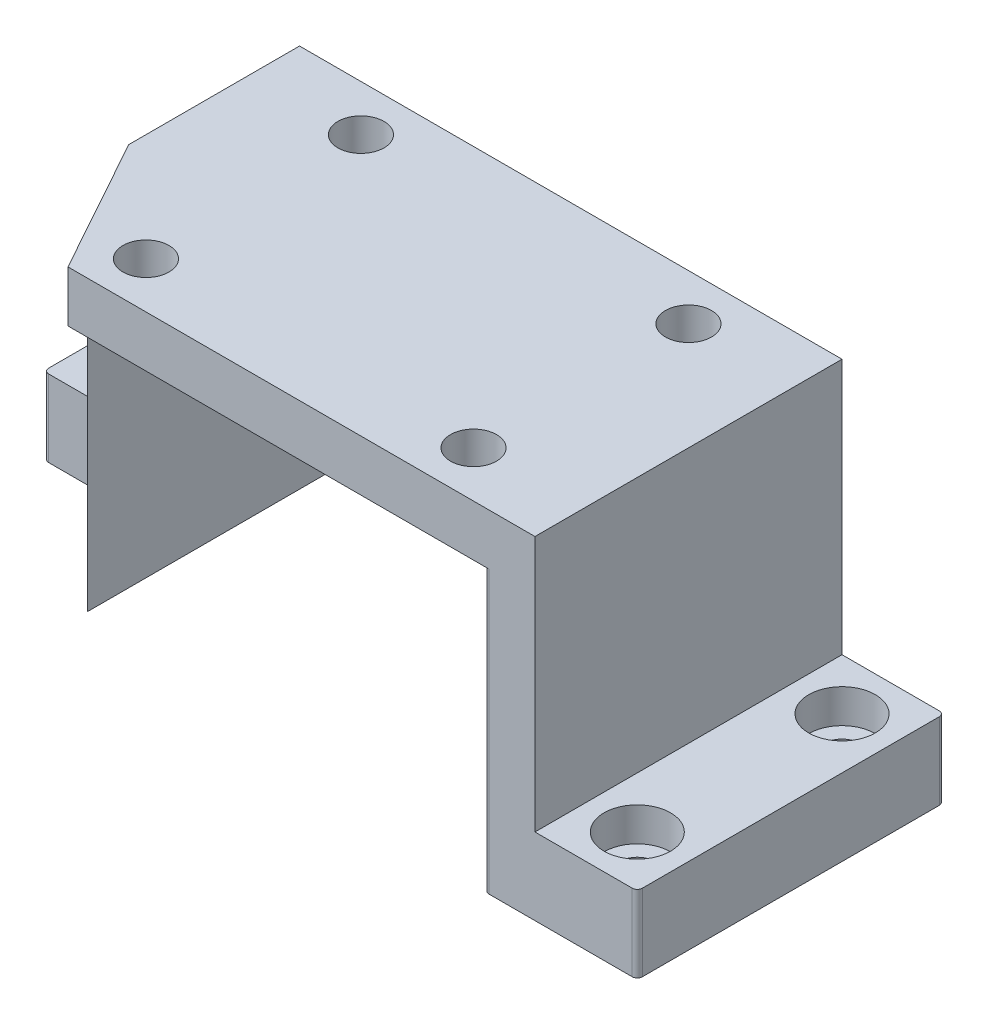
ISO-10303-21;
HEADER;
FILE_DESCRIPTION(('STEP AP214'),'2;1');
FILE_NAME('part.step','',(''),(''),'','','');
FILE_SCHEMA(('AUTOMOTIVE_DESIGN { 1 0 10303 214 1 1 1 1 }'));
ENDSEC;
DATA;
#1=APPLICATION_CONTEXT('core data for automotive mechanical design processes');
#2=APPLICATION_PROTOCOL_DEFINITION('international standard','automotive_design',2000,#1);
#3=PRODUCT_CONTEXT('',#1,'mechanical');
#4=PRODUCT('Part','Part','',(#3));
#5=PRODUCT_RELATED_PRODUCT_CATEGORY('part','',(#4));
#6=PRODUCT_DEFINITION_FORMATION('','',#4);
#7=PRODUCT_DEFINITION_CONTEXT('part definition',#1,'design');
#8=PRODUCT_DEFINITION('design','',#6,#7);
#9=PRODUCT_DEFINITION_SHAPE('','',#8);
#10=(LENGTH_UNIT() NAMED_UNIT(*) SI_UNIT(.MILLI.,.METRE.));
#11=(NAMED_UNIT(*) PLANE_ANGLE_UNIT() SI_UNIT($,.RADIAN.));
#12=(NAMED_UNIT(*) SI_UNIT($,.STERADIAN.) SOLID_ANGLE_UNIT());
#13=UNCERTAINTY_MEASURE_WITH_UNIT(LENGTH_MEASURE(1.E-05),#10,'distance_accuracy_value','');
#14=(GEOMETRIC_REPRESENTATION_CONTEXT(3) GLOBAL_UNCERTAINTY_ASSIGNED_CONTEXT((#13)) GLOBAL_UNIT_ASSIGNED_CONTEXT((#10,
#11,#12)) REPRESENTATION_CONTEXT('',''));
#15=CARTESIAN_POINT('',(0.,0.,0.));
#16=DIRECTION('',(0.,0.,1.));
#17=DIRECTION('',(1.,0.,0.));
#18=AXIS2_PLACEMENT_3D('',#15,#16,#17);
#19=CARTESIAN_POINT('',(-53.,10.,30.));
#20=DIRECTION('',(1.,0.,0.));
#21=DIRECTION('',(0.,0.,-1.));
#22=AXIS2_PLACEMENT_3D('',#19,#20,#21);
#23=PLANE('',#22);
#24=DIRECTION('',(0.,0.,-1.));
#25=VECTOR('',#24,1.);
#26=CARTESIAN_POINT('',(-53.,-55.,30.));
#27=LINE('',#26,#25);
#28=CARTESIAN_POINT('',(-53.,-55.,3.37045108443876));
#29=VERTEX_POINT('',#28);
#30=CARTESIAN_POINT('',(-53.,-55.,0.));
#31=VERTEX_POINT('',#30);
#32=EDGE_CURVE('E378',#29,#31,#27,.T.);
#33=ORIENTED_EDGE('',*,*,#32,.F.);
#34=DIRECTION('',(0.,1.,0.));
#35=VECTOR('',#34,1.);
#36=CARTESIAN_POINT('',(-53.,-55.,3.37045108443878));
#37=LINE('',#36,#35);
#38=CARTESIAN_POINT('',(-53.,10.,3.37045108443878));
#39=VERTEX_POINT('',#38);
#40=EDGE_CURVE('E194',#29,#39,#37,.T.);
#41=ORIENTED_EDGE('',*,*,#40,.T.);
#42=DIRECTION('',(0.,0.,1.));
#43=VECTOR('',#42,1.);
#44=CARTESIAN_POINT('',(-53.,10.,30.));
#45=LINE('',#44,#43);
#46=CARTESIAN_POINT('',(-53.,10.,-30.));
#47=VERTEX_POINT('',#46);
#48=EDGE_CURVE('E203',#47,#39,#45,.T.);
#49=ORIENTED_EDGE('',*,*,#48,.F.);
#50=DIRECTION('',(0.,-1.,0.));
#51=VECTOR('',#50,1.);
#52=CARTESIAN_POINT('',(-53.,10.,-30.));
#53=LINE('',#52,#51);
#54=CARTESIAN_POINT('',(-53.,-40.,-30.));
#55=VERTEX_POINT('',#54);
#56=EDGE_CURVE('E215',#47,#55,#53,.T.);
#57=ORIENTED_EDGE('',*,*,#56,.T.);
#58=DIRECTION('',(0.,0.,-1.));
#59=VECTOR('',#58,1.);
#60=CARTESIAN_POINT('',(-53.,-40.,-30.));
#61=LINE('',#60,#59);
#62=CARTESIAN_POINT('',(-53.,-40.,0.));
#63=VERTEX_POINT('',#62);
#64=EDGE_CURVE('E500',#63,#55,#61,.T.);
#65=ORIENTED_EDGE('',*,*,#64,.F.);
#66=DIRECTION('',(0.,1.,0.));
#67=VECTOR('',#66,1.);
#68=CARTESIAN_POINT('',(-53.,-40.,0.));
#69=LINE('',#68,#67);
#70=EDGE_CURVE('E494',#31,#63,#69,.T.);
#71=ORIENTED_EDGE('',*,*,#70,.F.);
#72=EDGE_LOOP('',(#33,#41,#49,#57,#65,#71));
#73=FACE_BOUND('',#72,.T.);
#74=ADVANCED_FACE('F42',(#73),#23,.F.);
#75=CARTESIAN_POINT('',(53.,10.,30.));
#76=DIRECTION('',(-1.,0.,0.));
#77=DIRECTION('',(0.,0.,1.));
#78=AXIS2_PLACEMENT_3D('',#75,#76,#77);
#79=PLANE('',#78);
#80=DIRECTION('',(0.,0.,1.));
#81=VECTOR('',#80,1.);
#82=CARTESIAN_POINT('',(53.,-40.,30.));
#83=LINE('',#82,#81);
#84=CARTESIAN_POINT('',(53.,-40.,-30.));
#85=VERTEX_POINT('',#84);
#86=CARTESIAN_POINT('',(53.,-40.,30.));
#87=VERTEX_POINT('',#86);
#88=EDGE_CURVE('E517',#85,#87,#83,.T.);
#89=ORIENTED_EDGE('',*,*,#88,.F.);
#90=DIRECTION('',(0.,-1.,0.));
#91=VECTOR('',#90,1.);
#92=CARTESIAN_POINT('',(53.,10.,-30.));
#93=LINE('',#92,#91);
#94=CARTESIAN_POINT('',(53.,10.,-30.));
#95=VERTEX_POINT('',#94);
#96=EDGE_CURVE('E231',#95,#85,#93,.T.);
#97=ORIENTED_EDGE('',*,*,#96,.F.);
#98=DIRECTION('',(0.,0.,-1.));
#99=VECTOR('',#98,1.);
#100=CARTESIAN_POINT('',(53.,10.,30.));
#101=LINE('',#100,#99);
#102=CARTESIAN_POINT('',(53.,10.,30.));
#103=VERTEX_POINT('',#102);
#104=EDGE_CURVE('E226',#103,#95,#101,.T.);
#105=ORIENTED_EDGE('',*,*,#104,.F.);
#106=DIRECTION('',(0.,-1.,0.));
#107=VECTOR('',#106,1.);
#108=CARTESIAN_POINT('',(53.,10.,30.));
#109=LINE('',#108,#107);
#110=EDGE_CURVE('E208',#103,#87,#109,.T.);
#111=ORIENTED_EDGE('',*,*,#110,.T.);
#112=EDGE_LOOP('',(#89,#97,#105,#111));
#113=FACE_BOUND('',#112,.T.);
#114=ADVANCED_FACE('F587',(#113),#79,.F.);
#115=CARTESIAN_POINT('',(0.,0.,0.));
#116=DIRECTION('',(0.,-1.,0.));
#117=DIRECTION('',(0.,0.,-1.));
#118=AXIS2_PLACEMENT_3D('',#115,#116,#117);
#119=PLANE('',#118);
#120=DIRECTION('',(0.484809620246341,0.,0.874619707139394));
#121=VECTOR('',#120,1.);
#122=CARTESIAN_POINT('',(-41.9720128148531,0.,23.2654666109649));
#123=LINE('',#122,#121);
#124=CARTESIAN_POINT('',(-43.,0.,21.4109286371528));
#125=VERTEX_POINT('',#124);
#126=CARTESIAN_POINT('',(-38.239,0.,30.));
#127=VERTEX_POINT('',#126);
#128=EDGE_CURVE('E191',#125,#127,#123,.T.);
#129=ORIENTED_EDGE('',*,*,#128,.F.);
#130=DIRECTION('',(0.,0.,1.));
#131=VECTOR('',#130,1.);
#132=CARTESIAN_POINT('',(-43.,0.,30.));
#133=LINE('',#132,#131);
#134=CARTESIAN_POINT('',(-43.,0.,-29.));
#135=VERTEX_POINT('',#134);
#136=EDGE_CURVE('E361',#135,#125,#133,.T.);
#137=ORIENTED_EDGE('',*,*,#136,.F.);
#138=CARTESIAN_POINT('',(-44.,0.,-29.));
#139=DIRECTION('',(0.,-1.,0.));
#140=DIRECTION('',(0.,0.,-1.));
#141=AXIS2_PLACEMENT_3D('',#138,#139,#140);
#142=CIRCLE('',#141,1.);
#143=CARTESIAN_POINT('',(-44.,0.,-30.));
#144=VERTEX_POINT('',#143);
#145=EDGE_CURVE('E321',#135,#144,#142,.F.);
#146=ORIENTED_EDGE('',*,*,#145,.T.);
#147=DIRECTION('',(-1.,0.,0.));
#148=VECTOR('',#147,1.);
#149=CARTESIAN_POINT('',(-53.,0.,-30.));
#150=LINE('',#149,#148);
#151=CARTESIAN_POINT('',(44.,0.,-30.));
#152=VERTEX_POINT('',#151);
#153=EDGE_CURVE('E221',#152,#144,#150,.T.);
#154=ORIENTED_EDGE('',*,*,#153,.F.);
#155=CARTESIAN_POINT('',(44.,0.,-29.));
#156=DIRECTION('',(0.,-1.,0.));
#157=DIRECTION('',(0.,0.,-1.));
#158=AXIS2_PLACEMENT_3D('',#155,#156,#157);
#159=CIRCLE('',#158,1.);
#160=CARTESIAN_POINT('',(43.,0.,-29.));
#161=VERTEX_POINT('',#160);
#162=EDGE_CURVE('E51',#152,#161,#159,.F.);
#163=ORIENTED_EDGE('',*,*,#162,.T.);
#164=DIRECTION('',(0.,0.,-1.));
#165=VECTOR('',#164,1.);
#166=CARTESIAN_POINT('',(43.,0.,30.));
#167=LINE('',#166,#165);
#168=CARTESIAN_POINT('',(43.,0.,29.));
#169=VERTEX_POINT('',#168);
#170=EDGE_CURVE('E535',#169,#161,#167,.T.);
#171=ORIENTED_EDGE('',*,*,#170,.F.);
#172=CARTESIAN_POINT('',(44.,0.,29.));
#173=DIRECTION('',(0.,-1.,0.));
#174=DIRECTION('',(0.,0.,-1.));
#175=AXIS2_PLACEMENT_3D('',#172,#173,#174);
#176=CIRCLE('',#175,1.);
#177=CARTESIAN_POINT('',(44.,0.,30.));
#178=VERTEX_POINT('',#177);
#179=EDGE_CURVE('E11',#169,#178,#176,.F.);
#180=ORIENTED_EDGE('',*,*,#179,.T.);
#181=DIRECTION('',(1.,0.,0.));
#182=VECTOR('',#181,1.);
#183=CARTESIAN_POINT('',(-53.,0.,30.));
#184=LINE('',#183,#182);
#185=EDGE_CURVE('E58',#127,#178,#184,.T.);
#186=ORIENTED_EDGE('',*,*,#185,.F.);
#187=EDGE_LOOP('',(#129,#137,#146,#154,#163,#171,#180,#186));
#188=FACE_BOUND('',#187,.T.);
#189=CARTESIAN_POINT('',(-32.,0.,21.));
#190=DIRECTION('',(0.,-1.,0.));
#191=DIRECTION('',(0.,0.,-1.));
#192=AXIS2_PLACEMENT_3D('',#189,#190,#191);
#193=CIRCLE('',#192,4.5);
#194=CARTESIAN_POINT('',(-32.,0.,16.5));
#195=VERTEX_POINT('',#194);
#196=EDGE_CURVE('E490',#195,#195,#193,.T.);
#197=ORIENTED_EDGE('',*,*,#196,.F.);
#198=EDGE_LOOP('',(#197));
#199=FACE_BOUND('',#198,.T.);
#200=CARTESIAN_POINT('',(32.,0.,21.));
#201=DIRECTION('',(0.,-1.,0.));
#202=DIRECTION('',(0.,0.,-1.));
#203=AXIS2_PLACEMENT_3D('',#200,#201,#202);
#204=CIRCLE('',#203,4.5);
#205=CARTESIAN_POINT('',(32.,0.,16.5));
#206=VERTEX_POINT('',#205);
#207=EDGE_CURVE('E486',#206,#206,#204,.T.);
#208=ORIENTED_EDGE('',*,*,#207,.F.);
#209=EDGE_LOOP('',(#208));
#210=FACE_BOUND('',#209,.T.);
#211=CARTESIAN_POINT('',(32.,0.,-21.));
#212=DIRECTION('',(0.,-1.,0.));
#213=DIRECTION('',(0.,0.,-1.));
#214=AXIS2_PLACEMENT_3D('',#211,#212,#213);
#215=CIRCLE('',#214,4.5);
#216=CARTESIAN_POINT('',(32.,0.,-25.5));
#217=VERTEX_POINT('',#216);
#218=EDGE_CURVE('E482',#217,#217,#215,.T.);
#219=ORIENTED_EDGE('',*,*,#218,.F.);
#220=EDGE_LOOP('',(#219));
#221=FACE_BOUND('',#220,.T.);
#222=CARTESIAN_POINT('',(-32.,0.,-21.));
#223=DIRECTION('',(0.,-1.,0.));
#224=DIRECTION('',(0.,0.,-1.));
#225=AXIS2_PLACEMENT_3D('',#222,#223,#224);
#226=CIRCLE('',#225,4.5);
#227=CARTESIAN_POINT('',(-32.,0.,-25.5));
#228=VERTEX_POINT('',#227);
#229=EDGE_CURVE('E478',#228,#228,#226,.T.);
#230=ORIENTED_EDGE('',*,*,#229,.F.);
#231=EDGE_LOOP('',(#230));
#232=FACE_BOUND('',#231,.T.);
#233=ADVANCED_FACE('F359',(#188,#199,#210,#221,#232),#119,.T.);
#234=CARTESIAN_POINT('',(-53.,10.,-30.));
#235=DIRECTION('',(0.,0.,1.));
#236=DIRECTION('',(1.,0.,0.));
#237=AXIS2_PLACEMENT_3D('',#234,#235,#236);
#238=PLANE('',#237);
#239=ORIENTED_EDGE('',*,*,#153,.T.);
#240=DIRECTION('',(0.,1.,0.));
#241=VECTOR('',#240,1.);
#242=CARTESIAN_POINT('',(-44.,10.,-30.));
#243=LINE('',#242,#241);
#244=CARTESIAN_POINT('',(-44.,-55.,-30.));
#245=VERTEX_POINT('',#244);
#246=EDGE_CURVE('E253',#144,#245,#243,.F.);
#247=ORIENTED_EDGE('',*,*,#246,.T.);
#248=DIRECTION('',(1.,0.,0.));
#249=VECTOR('',#248,1.);
#250=CARTESIAN_POINT('',(-53.,-55.,-30.));
#251=LINE('',#250,#249);
#252=CARTESIAN_POINT('',(-72.,-55.,-30.));
#253=VERTEX_POINT('',#252);
#254=EDGE_CURVE('E370',#253,#245,#251,.T.);
#255=ORIENTED_EDGE('',*,*,#254,.F.);
#256=DIRECTION('',(0.,-1.,0.));
#257=VECTOR('',#256,1.);
#258=CARTESIAN_POINT('',(-72.,10.,-30.));
#259=LINE('',#258,#257);
#260=CARTESIAN_POINT('',(-72.,-40.,-30.));
#261=VERTEX_POINT('',#260);
#262=EDGE_CURVE('E250',#253,#261,#259,.F.);
#263=ORIENTED_EDGE('',*,*,#262,.T.);
#264=DIRECTION('',(1.,0.,0.));
#265=VECTOR('',#264,1.);
#266=CARTESIAN_POINT('',(-73.,-40.,-30.));
#267=LINE('',#266,#265);
#268=EDGE_CURVE('E397',#261,#55,#267,.T.);
#269=ORIENTED_EDGE('',*,*,#268,.T.);
#270=ORIENTED_EDGE('',*,*,#56,.F.);
#271=DIRECTION('',(-1.,0.,0.));
#272=VECTOR('',#271,1.);
#273=CARTESIAN_POINT('',(-53.,10.,-30.));
#274=LINE('',#273,#272);
#275=EDGE_CURVE('E217',#95,#47,#274,.T.);
#276=ORIENTED_EDGE('',*,*,#275,.F.);
#277=ORIENTED_EDGE('',*,*,#96,.T.);
#278=DIRECTION('',(-1.,0.,0.));
#279=VECTOR('',#278,1.);
#280=CARTESIAN_POINT('',(73.,-40.,-30.));
#281=LINE('',#280,#279);
#282=CARTESIAN_POINT('',(72.,-40.,-30.));
#283=VERTEX_POINT('',#282);
#284=EDGE_CURVE('E532',#283,#85,#281,.T.);
#285=ORIENTED_EDGE('',*,*,#284,.F.);
#286=DIRECTION('',(0.,1.,0.));
#287=VECTOR('',#286,1.);
#288=CARTESIAN_POINT('',(72.,10.,-30.));
#289=LINE('',#288,#287);
#290=CARTESIAN_POINT('',(72.,-55.,-30.));
#291=VERTEX_POINT('',#290);
#292=EDGE_CURVE('E247',#283,#291,#289,.F.);
#293=ORIENTED_EDGE('',*,*,#292,.T.);
#294=DIRECTION('',(1.,0.,0.));
#295=VECTOR('',#294,1.);
#296=CARTESIAN_POINT('',(53.,-55.,-30.));
#297=LINE('',#296,#295);
#298=CARTESIAN_POINT('',(44.,-55.,-30.));
#299=VERTEX_POINT('',#298);
#300=EDGE_CURVE('E390',#299,#291,#297,.T.);
#301=ORIENTED_EDGE('',*,*,#300,.F.);
#302=DIRECTION('',(0.,1.,0.));
#303=VECTOR('',#302,1.);
#304=CARTESIAN_POINT('',(44.,10.,-30.));
#305=LINE('',#304,#303);
#306=EDGE_CURVE('E243',#299,#152,#305,.T.);
#307=ORIENTED_EDGE('',*,*,#306,.T.);
#308=EDGE_LOOP('',(#239,#247,#255,#263,#269,#270,#276,#277,#285,#293,#301,#307));
#309=FACE_BOUND('',#308,.T.);
#310=ADVANCED_FACE('F369',(#309),#238,.F.);
#311=CARTESIAN_POINT('',(-53.,10.,30.));
#312=DIRECTION('',(0.,0.,-1.));
#313=DIRECTION('',(-1.,0.,0.));
#314=AXIS2_PLACEMENT_3D('',#311,#312,#313);
#315=PLANE('',#314);
#316=ORIENTED_EDGE('',*,*,#185,.T.);
#317=DIRECTION('',(0.,1.,0.));
#318=VECTOR('',#317,1.);
#319=CARTESIAN_POINT('',(44.,10.,30.));
#320=LINE('',#319,#318);
#321=CARTESIAN_POINT('',(44.,-55.,30.));
#322=VERTEX_POINT('',#321);
#323=EDGE_CURVE('E318',#178,#322,#320,.F.);
#324=ORIENTED_EDGE('',*,*,#323,.T.);
#325=DIRECTION('',(-1.,0.,0.));
#326=VECTOR('',#325,1.);
#327=CARTESIAN_POINT('',(53.,-55.,30.));
#328=LINE('',#327,#326);
#329=CARTESIAN_POINT('',(72.,-55.,30.));
#330=VERTEX_POINT('',#329);
#331=EDGE_CURVE('E536',#330,#322,#328,.T.);
#332=ORIENTED_EDGE('',*,*,#331,.F.);
#333=DIRECTION('',(0.,-1.,0.));
#334=VECTOR('',#333,1.);
#335=CARTESIAN_POINT('',(72.,10.,30.));
#336=LINE('',#335,#334);
#337=CARTESIAN_POINT('',(72.,-40.,30.));
#338=VERTEX_POINT('',#337);
#339=EDGE_CURVE('E315',#330,#338,#336,.F.);
#340=ORIENTED_EDGE('',*,*,#339,.T.);
#341=DIRECTION('',(-1.,0.,0.));
#342=VECTOR('',#341,1.);
#343=CARTESIAN_POINT('',(73.,-40.,30.));
#344=LINE('',#343,#342);
#345=EDGE_CURVE('E526',#338,#87,#344,.T.);
#346=ORIENTED_EDGE('',*,*,#345,.T.);
#347=ORIENTED_EDGE('',*,*,#110,.F.);
#348=DIRECTION('',(1.,0.,0.));
#349=VECTOR('',#348,1.);
#350=CARTESIAN_POINT('',(-53.,10.,30.));
#351=LINE('',#350,#349);
#352=CARTESIAN_POINT('',(-38.239,10.,30.));
#353=VERTEX_POINT('',#352);
#354=EDGE_CURVE('E200',#353,#103,#351,.T.);
#355=ORIENTED_EDGE('',*,*,#354,.F.);
#356=DIRECTION('',(0.,1.,0.));
#357=VECTOR('',#356,1.);
#358=CARTESIAN_POINT('',(-38.239,-55.,30.));
#359=LINE('',#358,#357);
#360=EDGE_CURVE('E184',#127,#353,#359,.T.);
#361=ORIENTED_EDGE('',*,*,#360,.F.);
#362=EDGE_LOOP('',(#316,#324,#332,#340,#346,#347,#355,#361));
#363=FACE_BOUND('',#362,.T.);
#364=ADVANCED_FACE('F206',(#363),#315,.F.);
#365=CARTESIAN_POINT('',(0.,10.,0.));
#366=DIRECTION('',(0.,-1.,0.));
#367=DIRECTION('',(0.,0.,-1.));
#368=AXIS2_PLACEMENT_3D('',#365,#366,#367);
#369=PLANE('',#368);
#370=CARTESIAN_POINT('',(-32.,10.,21.));
#371=DIRECTION('',(0.,1.,0.));
#372=DIRECTION('',(0.,0.,-1.));
#373=AXIS2_PLACEMENT_3D('',#370,#371,#372);
#374=CIRCLE('',#373,4.5);
#375=CARTESIAN_POINT('',(-32.,10.,16.5));
#376=VERTEX_POINT('',#375);
#377=EDGE_CURVE('E459',#376,#376,#374,.T.);
#378=ORIENTED_EDGE('',*,*,#377,.F.);
#379=EDGE_LOOP('',(#378));
#380=FACE_BOUND('',#379,.T.);
#381=CARTESIAN_POINT('',(32.,10.,21.));
#382=DIRECTION('',(0.,1.,0.));
#383=DIRECTION('',(0.,0.,1.));
#384=AXIS2_PLACEMENT_3D('',#381,#382,#383);
#385=CIRCLE('',#384,4.5);
#386=CARTESIAN_POINT('',(32.,10.,25.5));
#387=VERTEX_POINT('',#386);
#388=EDGE_CURVE('E468',#387,#387,#385,.T.);
#389=ORIENTED_EDGE('',*,*,#388,.F.);
#390=EDGE_LOOP('',(#389));
#391=FACE_BOUND('',#390,.T.);
#392=CARTESIAN_POINT('',(32.,10.,-21.));
#393=DIRECTION('',(0.,1.,0.));
#394=DIRECTION('',(0.,0.,-1.));
#395=AXIS2_PLACEMENT_3D('',#392,#393,#394);
#396=CIRCLE('',#395,4.5);
#397=CARTESIAN_POINT('',(32.,10.,-25.5));
#398=VERTEX_POINT('',#397);
#399=EDGE_CURVE('E463',#398,#398,#396,.T.);
#400=ORIENTED_EDGE('',*,*,#399,.F.);
#401=EDGE_LOOP('',(#400));
#402=FACE_BOUND('',#401,.T.);
#403=CARTESIAN_POINT('',(-32.,10.,-21.));
#404=DIRECTION('',(0.,1.,0.));
#405=DIRECTION('',(0.,0.,1.));
#406=AXIS2_PLACEMENT_3D('',#403,#404,#405);
#407=CIRCLE('',#406,4.5);
#408=CARTESIAN_POINT('',(-32.,10.,-16.5));
#409=VERTEX_POINT('',#408);
#410=EDGE_CURVE('E467',#409,#409,#407,.T.);
#411=ORIENTED_EDGE('',*,*,#410,.F.);
#412=EDGE_LOOP('',(#411));
#413=FACE_BOUND('',#412,.T.);
#414=ORIENTED_EDGE('',*,*,#48,.T.);
#415=DIRECTION('',(-0.484809620246341,0.,-0.874619707139394));
#416=VECTOR('',#415,1.);
#417=CARTESIAN_POINT('',(-38.239,10.,30.));
#418=LINE('',#417,#416);
#419=EDGE_CURVE('E187',#353,#39,#418,.T.);
#420=ORIENTED_EDGE('',*,*,#419,.F.);
#421=ORIENTED_EDGE('',*,*,#354,.T.);
#422=ORIENTED_EDGE('',*,*,#104,.T.);
#423=ORIENTED_EDGE('',*,*,#275,.T.);
#424=EDGE_LOOP('',(#414,#420,#421,#422,#423));
#425=FACE_BOUND('',#424,.T.);
#426=ADVANCED_FACE('F198',(#380,#391,#402,#413,#425),#369,.F.);
#427=CARTESIAN_POINT('',(-43.,-55.,30.));
#428=DIRECTION('',(-1.,0.,0.));
#429=DIRECTION('',(0.,0.,1.));
#430=AXIS2_PLACEMENT_3D('',#427,#428,#429);
#431=PLANE('',#430);
#432=DIRECTION('',(0.,0.,1.));
#433=VECTOR('',#432,1.);
#434=CARTESIAN_POINT('',(-43.,-55.,30.));
#435=LINE('',#434,#433);
#436=CARTESIAN_POINT('',(-43.,-55.,-29.));
#437=VERTEX_POINT('',#436);
#438=CARTESIAN_POINT('',(-43.,-55.,21.4109286371528));
#439=VERTEX_POINT('',#438);
#440=EDGE_CURVE('E224',#437,#439,#435,.T.);
#441=ORIENTED_EDGE('',*,*,#440,.F.);
#442=DIRECTION('',(0.,1.,0.));
#443=VECTOR('',#442,1.);
#444=CARTESIAN_POINT('',(-43.,-55.,-29.));
#445=LINE('',#444,#443);
#446=EDGE_CURVE('E239',#437,#135,#445,.T.);
#447=ORIENTED_EDGE('',*,*,#446,.T.);
#448=ORIENTED_EDGE('',*,*,#136,.T.);
#449=DIRECTION('',(0.,-1.,0.));
#450=VECTOR('',#449,1.);
#451=CARTESIAN_POINT('',(-43.,-55.,21.4109286371528));
#452=LINE('',#451,#450);
#453=EDGE_CURVE('E405',#125,#439,#452,.T.);
#454=ORIENTED_EDGE('',*,*,#453,.T.);
#455=EDGE_LOOP('',(#441,#447,#448,#454));
#456=FACE_BOUND('',#455,.T.);
#457=ADVANCED_FACE('F839',(#456),#431,.F.);
#458=CARTESIAN_POINT('',(0.,-55.,0.));
#459=DIRECTION('',(0.,-1.,0.));
#460=DIRECTION('',(0.,0.,-1.));
#461=AXIS2_PLACEMENT_3D('',#458,#459,#460);
#462=PLANE('',#461);
#463=ORIENTED_EDGE('',*,*,#254,.T.);
#464=CARTESIAN_POINT('',(-44.,-55.,-29.));
#465=DIRECTION('',(0.,-1.,0.));
#466=DIRECTION('',(0.,0.,-1.));
#467=AXIS2_PLACEMENT_3D('',#464,#465,#466);
#468=CIRCLE('',#467,1.);
#469=EDGE_CURVE('E262',#245,#437,#468,.T.);
#470=ORIENTED_EDGE('',*,*,#469,.T.);
#471=ORIENTED_EDGE('',*,*,#440,.T.);
#472=DIRECTION('',(0.484809620246341,0.,0.874619707139394));
#473=VECTOR('',#472,1.);
#474=CARTESIAN_POINT('',(-41.9720128148531,-55.,23.2654666109649));
#475=LINE('',#474,#473);
#476=EDGE_CURVE('E235',#29,#439,#475,.T.);
#477=ORIENTED_EDGE('',*,*,#476,.F.);
#478=ORIENTED_EDGE('',*,*,#32,.T.);
#479=DIRECTION('',(1.,0.,0.));
#480=VECTOR('',#479,1.);
#481=CARTESIAN_POINT('',(-73.,-55.,0.));
#482=LINE('',#481,#480);
#483=CARTESIAN_POINT('',(-72.,-55.,0.));
#484=VERTEX_POINT('',#483);
#485=EDGE_CURVE('E514',#484,#31,#482,.T.);
#486=ORIENTED_EDGE('',*,*,#485,.F.);
#487=CARTESIAN_POINT('',(-72.,-55.,-1.));
#488=DIRECTION('',(0.,-1.,0.));
#489=DIRECTION('',(0.,0.,-1.));
#490=AXIS2_PLACEMENT_3D('',#487,#488,#489);
#491=CIRCLE('',#490,1.);
#492=CARTESIAN_POINT('',(-73.,-55.,-1.));
#493=VERTEX_POINT('',#492);
#494=EDGE_CURVE('E259',#484,#493,#491,.T.);
#495=ORIENTED_EDGE('',*,*,#494,.T.);
#496=DIRECTION('',(0.,0.,1.));
#497=VECTOR('',#496,1.);
#498=CARTESIAN_POINT('',(-73.,-55.,-30.));
#499=LINE('',#498,#497);
#500=CARTESIAN_POINT('',(-73.,-55.,-29.));
#501=VERTEX_POINT('',#500);
#502=EDGE_CURVE('E495',#501,#493,#499,.T.);
#503=ORIENTED_EDGE('',*,*,#502,.F.);
#504=CARTESIAN_POINT('',(-72.,-55.,-29.));
#505=DIRECTION('',(0.,-1.,0.));
#506=DIRECTION('',(0.,0.,-1.));
#507=AXIS2_PLACEMENT_3D('',#504,#505,#506);
#508=CIRCLE('',#507,1.);
#509=EDGE_CURVE('E256',#501,#253,#508,.T.);
#510=ORIENTED_EDGE('',*,*,#509,.T.);
#511=EDGE_LOOP('',(#463,#470,#471,#477,#478,#486,#495,#503,#510));
#512=FACE_BOUND('',#511,.T.);
#513=CARTESIAN_POINT('',(-63.,-55.,-20.));
#514=DIRECTION('',(0.,1.,0.));
#515=DIRECTION('',(0.,0.,1.));
#516=AXIS2_PLACEMENT_3D('',#513,#514,#515);
#517=CIRCLE('',#516,3.3);
#518=CARTESIAN_POINT('',(-63.,-55.,-16.7));
#519=VERTEX_POINT('',#518);
#520=EDGE_CURVE('E415',#519,#519,#517,.T.);
#521=ORIENTED_EDGE('',*,*,#520,.T.);
#522=EDGE_LOOP('',(#521));
#523=FACE_BOUND('',#522,.T.);
#524=ADVANCED_FACE('F373',(#512,#523),#462,.T.);
#525=CARTESIAN_POINT('',(43.,-55.,30.));
#526=DIRECTION('',(1.,0.,0.));
#527=DIRECTION('',(0.,0.,-1.));
#528=AXIS2_PLACEMENT_3D('',#525,#526,#527);
#529=PLANE('',#528);
#530=ORIENTED_EDGE('',*,*,#170,.T.);
#531=DIRECTION('',(0.,1.,0.));
#532=VECTOR('',#531,1.);
#533=CARTESIAN_POINT('',(43.,-55.,-29.));
#534=LINE('',#533,#532);
#535=CARTESIAN_POINT('',(43.,-55.,-29.));
#536=VERTEX_POINT('',#535);
#537=EDGE_CURVE('E312',#161,#536,#534,.F.);
#538=ORIENTED_EDGE('',*,*,#537,.T.);
#539=DIRECTION('',(0.,0.,-1.));
#540=VECTOR('',#539,1.);
#541=CARTESIAN_POINT('',(43.,-55.,30.));
#542=LINE('',#541,#540);
#543=CARTESIAN_POINT('',(43.,-55.,29.));
#544=VERTEX_POINT('',#543);
#545=EDGE_CURVE('E540',#544,#536,#542,.T.);
#546=ORIENTED_EDGE('',*,*,#545,.F.);
#547=DIRECTION('',(0.,1.,0.));
#548=VECTOR('',#547,1.);
#549=CARTESIAN_POINT('',(43.,-55.,29.));
#550=LINE('',#549,#548);
#551=EDGE_CURVE('E308',#544,#169,#550,.T.);
#552=ORIENTED_EDGE('',*,*,#551,.T.);
#553=EDGE_LOOP('',(#530,#538,#546,#552));
#554=FACE_BOUND('',#553,.T.);
#555=ADVANCED_FACE('F550',(#554),#529,.F.);
#556=CARTESIAN_POINT('',(0.,-55.,0.));
#557=DIRECTION('',(0.,1.,0.));
#558=DIRECTION('',(0.,0.,1.));
#559=AXIS2_PLACEMENT_3D('',#556,#557,#558);
#560=PLANE('',#559);
#561=CARTESIAN_POINT('',(63.,-55.,20.));
#562=DIRECTION('',(0.,1.,0.));
#563=DIRECTION('',(0.,0.,1.));
#564=AXIS2_PLACEMENT_3D('',#561,#562,#563);
#565=CIRCLE('',#564,3.29999999999999);
#566=CARTESIAN_POINT('',(63.,-55.,23.3));
#567=VERTEX_POINT('',#566);
#568=EDGE_CURVE('E424',#567,#567,#565,.T.);
#569=ORIENTED_EDGE('',*,*,#568,.T.);
#570=EDGE_LOOP('',(#569));
#571=FACE_BOUND('',#570,.T.);
#572=CARTESIAN_POINT('',(63.,-55.,-20.));
#573=DIRECTION('',(0.,1.,0.));
#574=DIRECTION('',(0.,0.,1.));
#575=AXIS2_PLACEMENT_3D('',#572,#573,#574);
#576=CIRCLE('',#575,3.29999999999999);
#577=CARTESIAN_POINT('',(63.,-55.,-16.7));
#578=VERTEX_POINT('',#577);
#579=EDGE_CURVE('E432',#578,#578,#576,.T.);
#580=ORIENTED_EDGE('',*,*,#579,.T.);
#581=EDGE_LOOP('',(#580));
#582=FACE_BOUND('',#581,.T.);
#583=ORIENTED_EDGE('',*,*,#300,.T.);
#584=CARTESIAN_POINT('',(72.,-55.,-29.));
#585=DIRECTION('',(0.,1.,0.));
#586=DIRECTION('',(0.,0.,1.));
#587=AXIS2_PLACEMENT_3D('',#584,#585,#586);
#588=CIRCLE('',#587,1.);
#589=CARTESIAN_POINT('',(73.,-55.,-29.));
#590=VERTEX_POINT('',#589);
#591=EDGE_CURVE('E305',#291,#590,#588,.F.);
#592=ORIENTED_EDGE('',*,*,#591,.T.);
#593=DIRECTION('',(0.,0.,-1.));
#594=VECTOR('',#593,1.);
#595=CARTESIAN_POINT('',(73.,-55.,30.));
#596=LINE('',#595,#594);
#597=CARTESIAN_POINT('',(73.,-55.,29.));
#598=VERTEX_POINT('',#597);
#599=EDGE_CURVE('E518',#598,#590,#596,.T.);
#600=ORIENTED_EDGE('',*,*,#599,.F.);
#601=CARTESIAN_POINT('',(72.,-55.,29.));
#602=DIRECTION('',(0.,1.,0.));
#603=DIRECTION('',(0.,0.,1.));
#604=AXIS2_PLACEMENT_3D('',#601,#602,#603);
#605=CIRCLE('',#604,1.);
#606=EDGE_CURVE('E296',#598,#330,#605,.F.);
#607=ORIENTED_EDGE('',*,*,#606,.T.);
#608=ORIENTED_EDGE('',*,*,#331,.T.);
#609=CARTESIAN_POINT('',(44.,-55.,29.));
#610=DIRECTION('',(0.,1.,0.));
#611=DIRECTION('',(0.,0.,1.));
#612=AXIS2_PLACEMENT_3D('',#609,#610,#611);
#613=CIRCLE('',#612,1.);
#614=EDGE_CURVE('E299',#322,#544,#613,.F.);
#615=ORIENTED_EDGE('',*,*,#614,.T.);
#616=ORIENTED_EDGE('',*,*,#545,.T.);
#617=CARTESIAN_POINT('',(44.,-55.,-29.));
#618=DIRECTION('',(0.,1.,0.));
#619=DIRECTION('',(0.,0.,1.));
#620=AXIS2_PLACEMENT_3D('',#617,#618,#619);
#621=CIRCLE('',#620,1.);
#622=EDGE_CURVE('E302',#536,#299,#621,.F.);
#623=ORIENTED_EDGE('',*,*,#622,.T.);
#624=EDGE_LOOP('',(#583,#592,#600,#607,#608,#615,#616,#623));
#625=FACE_BOUND('',#624,.T.);
#626=ADVANCED_FACE('F559',(#571,#582,#625),#560,.F.);
#627=CARTESIAN_POINT('',(73.,-40.,30.));
#628=DIRECTION('',(0.,-1.,0.));
#629=DIRECTION('',(0.,0.,-1.));
#630=AXIS2_PLACEMENT_3D('',#627,#628,#629);
#631=PLANE('',#630);
#632=CARTESIAN_POINT('',(63.,-40.,20.));
#633=DIRECTION('',(0.,1.,0.));
#634=DIRECTION('',(0.,0.,1.));
#635=AXIS2_PLACEMENT_3D('',#632,#633,#634);
#636=CIRCLE('',#635,6.5);
#637=CARTESIAN_POINT('',(63.,-40.,26.5));
#638=VERTEX_POINT('',#637);
#639=EDGE_CURVE('E444',#638,#638,#636,.T.);
#640=ORIENTED_EDGE('',*,*,#639,.F.);
#641=EDGE_LOOP('',(#640));
#642=FACE_BOUND('',#641,.T.);
#643=CARTESIAN_POINT('',(63.,-40.,-20.));
#644=DIRECTION('',(0.,1.,0.));
#645=DIRECTION('',(0.,0.,1.));
#646=AXIS2_PLACEMENT_3D('',#643,#644,#645);
#647=CIRCLE('',#646,6.5);
#648=CARTESIAN_POINT('',(63.,-40.,-13.5));
#649=VERTEX_POINT('',#648);
#650=EDGE_CURVE('E443',#649,#649,#647,.T.);
#651=ORIENTED_EDGE('',*,*,#650,.F.);
#652=EDGE_LOOP('',(#651));
#653=FACE_BOUND('',#652,.T.);
#654=DIRECTION('',(0.,0.,1.));
#655=VECTOR('',#654,1.);
#656=CARTESIAN_POINT('',(73.,-40.,30.));
#657=LINE('',#656,#655);
#658=CARTESIAN_POINT('',(73.,-40.,-29.));
#659=VERTEX_POINT('',#658);
#660=CARTESIAN_POINT('',(73.,-40.,29.));
#661=VERTEX_POINT('',#660);
#662=EDGE_CURVE('E522',#659,#661,#657,.T.);
#663=ORIENTED_EDGE('',*,*,#662,.F.);
#664=CARTESIAN_POINT('',(72.,-40.,-29.));
#665=DIRECTION('',(0.,-1.,0.));
#666=DIRECTION('',(0.,0.,-1.));
#667=AXIS2_PLACEMENT_3D('',#664,#665,#666);
#668=CIRCLE('',#667,1.);
#669=EDGE_CURVE('E293',#659,#283,#668,.F.);
#670=ORIENTED_EDGE('',*,*,#669,.T.);
#671=ORIENTED_EDGE('',*,*,#284,.T.);
#672=ORIENTED_EDGE('',*,*,#88,.T.);
#673=ORIENTED_EDGE('',*,*,#345,.F.);
#674=CARTESIAN_POINT('',(72.,-40.,29.));
#675=DIRECTION('',(0.,-1.,0.));
#676=DIRECTION('',(0.,0.,-1.));
#677=AXIS2_PLACEMENT_3D('',#674,#675,#676);
#678=CIRCLE('',#677,1.);
#679=EDGE_CURVE('E290',#338,#661,#678,.F.);
#680=ORIENTED_EDGE('',*,*,#679,.T.);
#681=EDGE_LOOP('',(#663,#670,#671,#672,#673,#680));
#682=FACE_BOUND('',#681,.T.);
#683=ADVANCED_FACE('F906',(#642,#653,#682),#631,.F.);
#684=CARTESIAN_POINT('',(73.,0.,0.));
#685=DIRECTION('',(-1.,0.,0.));
#686=DIRECTION('',(0.,0.,1.));
#687=AXIS2_PLACEMENT_3D('',#684,#685,#686);
#688=PLANE('',#687);
#689=ORIENTED_EDGE('',*,*,#599,.T.);
#690=DIRECTION('',(0.,1.,0.));
#691=VECTOR('',#690,1.);
#692=CARTESIAN_POINT('',(73.,0.,-29.));
#693=LINE('',#692,#691);
#694=EDGE_CURVE('E286',#590,#659,#693,.T.);
#695=ORIENTED_EDGE('',*,*,#694,.T.);
#696=ORIENTED_EDGE('',*,*,#662,.T.);
#697=DIRECTION('',(0.,-1.,0.));
#698=VECTOR('',#697,1.);
#699=CARTESIAN_POINT('',(73.,0.,29.));
#700=LINE('',#699,#698);
#701=EDGE_CURVE('E282',#661,#598,#700,.T.);
#702=ORIENTED_EDGE('',*,*,#701,.T.);
#703=EDGE_LOOP('',(#689,#695,#696,#702));
#704=FACE_BOUND('',#703,.T.);
#705=ADVANCED_FACE('F568',(#704),#688,.F.);
#706=CARTESIAN_POINT('',(-73.,-40.,0.));
#707=DIRECTION('',(0.,0.,-1.));
#708=DIRECTION('',(-1.,0.,0.));
#709=AXIS2_PLACEMENT_3D('',#706,#707,#708);
#710=PLANE('',#709);
#711=DIRECTION('',(1.,0.,0.));
#712=VECTOR('',#711,1.);
#713=CARTESIAN_POINT('',(-73.,-40.,0.));
#714=LINE('',#713,#712);
#715=CARTESIAN_POINT('',(-72.,-40.,0.));
#716=VERTEX_POINT('',#715);
#717=EDGE_CURVE('E511',#716,#63,#714,.T.);
#718=ORIENTED_EDGE('',*,*,#717,.F.);
#719=DIRECTION('',(0.,1.,0.));
#720=VECTOR('',#719,1.);
#721=CARTESIAN_POINT('',(-72.,-40.,0.));
#722=LINE('',#721,#720);
#723=EDGE_CURVE('E279',#716,#484,#722,.F.);
#724=ORIENTED_EDGE('',*,*,#723,.T.);
#725=ORIENTED_EDGE('',*,*,#485,.T.);
#726=ORIENTED_EDGE('',*,*,#70,.T.);
#727=EDGE_LOOP('',(#718,#724,#725,#726));
#728=FACE_BOUND('',#727,.T.);
#729=ADVANCED_FACE('F818',(#728),#710,.F.);
#730=CARTESIAN_POINT('',(-73.,-40.,-30.));
#731=DIRECTION('',(0.,-1.,0.));
#732=DIRECTION('',(0.,0.,-1.));
#733=AXIS2_PLACEMENT_3D('',#730,#731,#732);
#734=PLANE('',#733);
#735=CARTESIAN_POINT('',(-63.,-40.,-20.));
#736=DIRECTION('',(0.,1.,0.));
#737=DIRECTION('',(0.,0.,1.));
#738=AXIS2_PLACEMENT_3D('',#735,#736,#737);
#739=CIRCLE('',#738,6.5);
#740=CARTESIAN_POINT('',(-63.,-40.,-13.5));
#741=VERTEX_POINT('',#740);
#742=EDGE_CURVE('E419',#741,#741,#739,.T.);
#743=ORIENTED_EDGE('',*,*,#742,.F.);
#744=EDGE_LOOP('',(#743));
#745=FACE_BOUND('',#744,.T.);
#746=DIRECTION('',(0.,0.,-1.));
#747=VECTOR('',#746,1.);
#748=CARTESIAN_POINT('',(-73.,-40.,-30.));
#749=LINE('',#748,#747);
#750=CARTESIAN_POINT('',(-73.,-40.,-1.));
#751=VERTEX_POINT('',#750);
#752=CARTESIAN_POINT('',(-73.,-40.,-29.));
#753=VERTEX_POINT('',#752);
#754=EDGE_CURVE('E499',#751,#753,#749,.T.);
#755=ORIENTED_EDGE('',*,*,#754,.F.);
#756=CARTESIAN_POINT('',(-72.,-40.,-1.));
#757=DIRECTION('',(0.,-1.,0.));
#758=DIRECTION('',(0.,0.,-1.));
#759=AXIS2_PLACEMENT_3D('',#756,#757,#758);
#760=CIRCLE('',#759,1.);
#761=EDGE_CURVE('E276',#751,#716,#760,.F.);
#762=ORIENTED_EDGE('',*,*,#761,.T.);
#763=ORIENTED_EDGE('',*,*,#717,.T.);
#764=ORIENTED_EDGE('',*,*,#64,.T.);
#765=ORIENTED_EDGE('',*,*,#268,.F.);
#766=CARTESIAN_POINT('',(-72.,-40.,-29.));
#767=DIRECTION('',(0.,-1.,0.));
#768=DIRECTION('',(0.,0.,-1.));
#769=AXIS2_PLACEMENT_3D('',#766,#767,#768);
#770=CIRCLE('',#769,1.);
#771=EDGE_CURVE('E273',#261,#753,#770,.F.);
#772=ORIENTED_EDGE('',*,*,#771,.T.);
#773=EDGE_LOOP('',(#755,#762,#763,#764,#765,#772));
#774=FACE_BOUND('',#773,.T.);
#775=ADVANCED_FACE('F808',(#745,#774),#734,.F.);
#776=CARTESIAN_POINT('',(-73.,0.,0.));
#777=DIRECTION('',(1.,0.,0.));
#778=DIRECTION('',(0.,0.,-1.));
#779=AXIS2_PLACEMENT_3D('',#776,#777,#778);
#780=PLANE('',#779);
#781=ORIENTED_EDGE('',*,*,#502,.T.);
#782=DIRECTION('',(0.,1.,0.));
#783=VECTOR('',#782,1.);
#784=CARTESIAN_POINT('',(-73.,0.,-1.));
#785=LINE('',#784,#783);
#786=EDGE_CURVE('E269',#493,#751,#785,.T.);
#787=ORIENTED_EDGE('',*,*,#786,.T.);
#788=ORIENTED_EDGE('',*,*,#754,.T.);
#789=DIRECTION('',(0.,-1.,0.));
#790=VECTOR('',#789,1.);
#791=CARTESIAN_POINT('',(-73.,0.,-29.));
#792=LINE('',#791,#790);
#793=EDGE_CURVE('E265',#753,#501,#792,.T.);
#794=ORIENTED_EDGE('',*,*,#793,.T.);
#795=EDGE_LOOP('',(#781,#787,#788,#794));
#796=FACE_BOUND('',#795,.T.);
#797=ADVANCED_FACE('F798',(#796),#780,.F.);
#798=CARTESIAN_POINT('',(-32.,-55.,-21.));
#799=DIRECTION('',(0.,1.,0.));
#800=DIRECTION('',(0.,0.,1.));
#801=AXIS2_PLACEMENT_3D('',#798,#799,#800);
#802=CYLINDRICAL_SURFACE('',#801,4.5);
#803=ORIENTED_EDGE('',*,*,#229,.T.);
#804=EDGE_LOOP('',(#803));
#805=FACE_BOUND('',#804,.T.);
#806=ORIENTED_EDGE('',*,*,#410,.T.);
#807=EDGE_LOOP('',(#806));
#808=FACE_BOUND('',#807,.T.);
#809=ADVANCED_FACE('F788',(#805,#808),#802,.F.);
#810=CARTESIAN_POINT('',(32.,-55.,-21.));
#811=DIRECTION('',(0.,1.,0.));
#812=DIRECTION('',(0.,0.,1.));
#813=AXIS2_PLACEMENT_3D('',#810,#811,#812);
#814=CYLINDRICAL_SURFACE('',#813,4.5);
#815=ORIENTED_EDGE('',*,*,#218,.T.);
#816=EDGE_LOOP('',(#815));
#817=FACE_BOUND('',#816,.T.);
#818=ORIENTED_EDGE('',*,*,#399,.T.);
#819=EDGE_LOOP('',(#818));
#820=FACE_BOUND('',#819,.T.);
#821=ADVANCED_FACE('F778',(#817,#820),#814,.F.);
#822=CARTESIAN_POINT('',(32.,-55.,21.));
#823=DIRECTION('',(0.,1.,0.));
#824=DIRECTION('',(0.,0.,1.));
#825=AXIS2_PLACEMENT_3D('',#822,#823,#824);
#826=CYLINDRICAL_SURFACE('',#825,4.5);
#827=ORIENTED_EDGE('',*,*,#207,.T.);
#828=EDGE_LOOP('',(#827));
#829=FACE_BOUND('',#828,.T.);
#830=ORIENTED_EDGE('',*,*,#388,.T.);
#831=EDGE_LOOP('',(#830));
#832=FACE_BOUND('',#831,.T.);
#833=ADVANCED_FACE('F768',(#829,#832),#826,.F.);
#834=CARTESIAN_POINT('',(-32.,-55.,21.));
#835=DIRECTION('',(0.,1.,0.));
#836=DIRECTION('',(0.,0.,1.));
#837=AXIS2_PLACEMENT_3D('',#834,#835,#836);
#838=CYLINDRICAL_SURFACE('',#837,4.5);
#839=ORIENTED_EDGE('',*,*,#196,.T.);
#840=EDGE_LOOP('',(#839));
#841=FACE_BOUND('',#840,.T.);
#842=ORIENTED_EDGE('',*,*,#377,.T.);
#843=EDGE_LOOP('',(#842));
#844=FACE_BOUND('',#843,.T.);
#845=ADVANCED_FACE('F758',(#841,#844),#838,.F.);
#846=CARTESIAN_POINT('',(-63.,-46.6,-20.));
#847=DIRECTION('',(0.,1.,0.));
#848=DIRECTION('',(0.,0.,1.));
#849=AXIS2_PLACEMENT_3D('',#846,#847,#848);
#850=CYLINDRICAL_SURFACE('',#849,6.5);
#851=CARTESIAN_POINT('',(-63.,-46.6,-20.));
#852=DIRECTION('',(0.,1.,0.));
#853=DIRECTION('',(0.,0.,1.));
#854=AXIS2_PLACEMENT_3D('',#851,#852,#853);
#855=CIRCLE('',#854,6.5);
#856=CARTESIAN_POINT('',(-63.,-46.6,-13.5));
#857=VERTEX_POINT('',#856);
#858=EDGE_CURVE('E448',#857,#857,#855,.T.);
#859=ORIENTED_EDGE('',*,*,#858,.F.);
#860=EDGE_LOOP('',(#859));
#861=FACE_BOUND('',#860,.T.);
#862=ORIENTED_EDGE('',*,*,#742,.T.);
#863=EDGE_LOOP('',(#862));
#864=FACE_BOUND('',#863,.T.);
#865=ADVANCED_FACE('F749',(#861,#864),#850,.F.);
#866=CARTESIAN_POINT('',(-63.,-46.6,-20.));
#867=DIRECTION('',(0.,1.,0.));
#868=DIRECTION('',(0.,0.,1.));
#869=AXIS2_PLACEMENT_3D('',#866,#867,#868);
#870=PLANE('',#869);
#871=CARTESIAN_POINT('',(-63.,-46.6,-20.));
#872=DIRECTION('',(0.,1.,0.));
#873=DIRECTION('',(0.,0.,1.));
#874=AXIS2_PLACEMENT_3D('',#871,#872,#873);
#875=CIRCLE('',#874,3.3);
#876=CARTESIAN_POINT('',(-63.,-46.6,-16.7));
#877=VERTEX_POINT('',#876);
#878=EDGE_CURVE('E420',#877,#877,#875,.T.);
#879=ORIENTED_EDGE('',*,*,#878,.F.);
#880=EDGE_LOOP('',(#879));
#881=FACE_BOUND('',#880,.T.);
#882=ORIENTED_EDGE('',*,*,#858,.T.);
#883=EDGE_LOOP('',(#882));
#884=FACE_BOUND('',#883,.T.);
#885=ADVANCED_FACE('F739',(#881,#884),#870,.T.);
#886=CARTESIAN_POINT('',(63.,-46.6,-20.));
#887=DIRECTION('',(0.,1.,0.));
#888=DIRECTION('',(0.,0.,1.));
#889=AXIS2_PLACEMENT_3D('',#886,#887,#888);
#890=CYLINDRICAL_SURFACE('',#889,6.5);
#891=CARTESIAN_POINT('',(63.,-46.6,-20.));
#892=DIRECTION('',(0.,1.,0.));
#893=DIRECTION('',(0.,0.,1.));
#894=AXIS2_PLACEMENT_3D('',#891,#892,#893);
#895=CIRCLE('',#894,6.5);
#896=CARTESIAN_POINT('',(63.,-46.6,-13.5));
#897=VERTEX_POINT('',#896);
#898=EDGE_CURVE('E455',#897,#897,#895,.T.);
#899=ORIENTED_EDGE('',*,*,#898,.F.);
#900=EDGE_LOOP('',(#899));
#901=FACE_BOUND('',#900,.T.);
#902=ORIENTED_EDGE('',*,*,#650,.T.);
#903=EDGE_LOOP('',(#902));
#904=FACE_BOUND('',#903,.T.);
#905=ADVANCED_FACE('F730',(#901,#904),#890,.F.);
#906=CARTESIAN_POINT('',(63.,-46.6,-20.));
#907=DIRECTION('',(0.,1.,0.));
#908=DIRECTION('',(0.,0.,1.));
#909=AXIS2_PLACEMENT_3D('',#906,#907,#908);
#910=PLANE('',#909);
#911=CARTESIAN_POINT('',(63.,-46.6,-20.));
#912=DIRECTION('',(0.,1.,0.));
#913=DIRECTION('',(0.,0.,1.));
#914=AXIS2_PLACEMENT_3D('',#911,#912,#913);
#915=CIRCLE('',#914,3.29999999999999);
#916=CARTESIAN_POINT('',(63.,-46.6,-16.7));
#917=VERTEX_POINT('',#916);
#918=EDGE_CURVE('E414',#917,#917,#915,.T.);
#919=ORIENTED_EDGE('',*,*,#918,.F.);
#920=EDGE_LOOP('',(#919));
#921=FACE_BOUND('',#920,.T.);
#922=ORIENTED_EDGE('',*,*,#898,.T.);
#923=EDGE_LOOP('',(#922));
#924=FACE_BOUND('',#923,.T.);
#925=ADVANCED_FACE('F719',(#921,#924),#910,.T.);
#926=CARTESIAN_POINT('',(63.,-46.6,20.));
#927=DIRECTION('',(0.,1.,0.));
#928=DIRECTION('',(0.,0.,1.));
#929=AXIS2_PLACEMENT_3D('',#926,#927,#928);
#930=CYLINDRICAL_SURFACE('',#929,6.5);
#931=CARTESIAN_POINT('',(63.,-46.6,20.));
#932=DIRECTION('',(0.,1.,0.));
#933=DIRECTION('',(0.,0.,1.));
#934=AXIS2_PLACEMENT_3D('',#931,#932,#933);
#935=CIRCLE('',#934,6.5);
#936=CARTESIAN_POINT('',(63.,-46.6,26.5));
#937=VERTEX_POINT('',#936);
#938=EDGE_CURVE('E439',#937,#937,#935,.T.);
#939=ORIENTED_EDGE('',*,*,#938,.F.);
#940=EDGE_LOOP('',(#939));
#941=FACE_BOUND('',#940,.T.);
#942=ORIENTED_EDGE('',*,*,#639,.T.);
#943=EDGE_LOOP('',(#942));
#944=FACE_BOUND('',#943,.T.);
#945=ADVANCED_FACE('F708',(#941,#944),#930,.F.);
#946=CARTESIAN_POINT('',(63.,-46.6,20.));
#947=DIRECTION('',(0.,1.,0.));
#948=DIRECTION('',(0.,0.,1.));
#949=AXIS2_PLACEMENT_3D('',#946,#947,#948);
#950=PLANE('',#949);
#951=CARTESIAN_POINT('',(63.,-46.6,20.));
#952=DIRECTION('',(0.,1.,0.));
#953=DIRECTION('',(0.,0.,1.));
#954=AXIS2_PLACEMENT_3D('',#951,#952,#953);
#955=CIRCLE('',#954,3.29999999999999);
#956=CARTESIAN_POINT('',(63.,-46.6,23.3));
#957=VERTEX_POINT('',#956);
#958=EDGE_CURVE('E428',#957,#957,#955,.T.);
#959=ORIENTED_EDGE('',*,*,#958,.F.);
#960=EDGE_LOOP('',(#959));
#961=FACE_BOUND('',#960,.T.);
#962=ORIENTED_EDGE('',*,*,#938,.T.);
#963=EDGE_LOOP('',(#962));
#964=FACE_BOUND('',#963,.T.);
#965=ADVANCED_FACE('F698',(#961,#964),#950,.T.);
#966=CARTESIAN_POINT('',(63.,-55.,-20.));
#967=DIRECTION('',(0.,1.,0.));
#968=DIRECTION('',(0.,0.,1.));
#969=AXIS2_PLACEMENT_3D('',#966,#967,#968);
#970=CYLINDRICAL_SURFACE('',#969,3.29999999999999);
#971=ORIENTED_EDGE('',*,*,#579,.F.);
#972=EDGE_LOOP('',(#971));
#973=FACE_BOUND('',#972,.T.);
#974=ORIENTED_EDGE('',*,*,#918,.T.);
#975=EDGE_LOOP('',(#974));
#976=FACE_BOUND('',#975,.T.);
#977=ADVANCED_FACE('F688',(#973,#976),#970,.F.);
#978=CARTESIAN_POINT('',(63.,-55.,20.));
#979=DIRECTION('',(0.,1.,0.));
#980=DIRECTION('',(0.,0.,1.));
#981=AXIS2_PLACEMENT_3D('',#978,#979,#980);
#982=CYLINDRICAL_SURFACE('',#981,3.29999999999999);
#983=ORIENTED_EDGE('',*,*,#568,.F.);
#984=EDGE_LOOP('',(#983));
#985=FACE_BOUND('',#984,.T.);
#986=ORIENTED_EDGE('',*,*,#958,.T.);
#987=EDGE_LOOP('',(#986));
#988=FACE_BOUND('',#987,.T.);
#989=ADVANCED_FACE('F677',(#985,#988),#982,.F.);
#990=CARTESIAN_POINT('',(-63.,-55.,-20.));
#991=DIRECTION('',(0.,1.,0.));
#992=DIRECTION('',(0.,0.,1.));
#993=AXIS2_PLACEMENT_3D('',#990,#991,#992);
#994=CYLINDRICAL_SURFACE('',#993,3.3);
#995=ORIENTED_EDGE('',*,*,#520,.F.);
#996=EDGE_LOOP('',(#995));
#997=FACE_BOUND('',#996,.T.);
#998=ORIENTED_EDGE('',*,*,#878,.T.);
#999=EDGE_LOOP('',(#998));
#1000=FACE_BOUND('',#999,.T.);
#1001=ADVANCED_FACE('F666',(#997,#1000),#994,.F.);
#1002=CARTESIAN_POINT('',(-38.239,-55.,30.));
#1003=DIRECTION('',(0.874619707139394,0.,-0.484809620246341));
#1004=DIRECTION('',(-0.484809620246341,0.,-0.874619707139394));
#1005=AXIS2_PLACEMENT_3D('',#1002,#1003,#1004);
#1006=PLANE('',#1005);
#1007=ORIENTED_EDGE('',*,*,#128,.T.);
#1008=ORIENTED_EDGE('',*,*,#360,.T.);
#1009=ORIENTED_EDGE('',*,*,#419,.T.);
#1010=ORIENTED_EDGE('',*,*,#40,.F.);
#1011=ORIENTED_EDGE('',*,*,#476,.T.);
#1012=ORIENTED_EDGE('',*,*,#453,.F.);
#1013=EDGE_LOOP('',(#1007,#1008,#1009,#1010,#1011,#1012));
#1014=FACE_BOUND('',#1013,.T.);
#1015=ADVANCED_FACE('F186',(#1014),#1006,.F.);
#1016=CARTESIAN_POINT('',(-44.,-55.,-29.));
#1017=DIRECTION('',(0.,1.,0.));
#1018=DIRECTION('',(0.,0.,1.));
#1019=AXIS2_PLACEMENT_3D('',#1016,#1017,#1018);
#1020=CYLINDRICAL_SURFACE('',#1019,1.);
#1021=ORIENTED_EDGE('',*,*,#469,.F.);
#1022=ORIENTED_EDGE('',*,*,#246,.F.);
#1023=ORIENTED_EDGE('',*,*,#145,.F.);
#1024=ORIENTED_EDGE('',*,*,#446,.F.);
#1025=EDGE_LOOP('',(#1021,#1022,#1023,#1024));
#1026=FACE_BOUND('',#1025,.T.);
#1027=ADVANCED_FACE('F365',(#1026),#1020,.T.);
#1028=CARTESIAN_POINT('',(-72.,0.,-1.));
#1029=DIRECTION('',(0.,1.,0.));
#1030=DIRECTION('',(0.,0.,1.));
#1031=AXIS2_PLACEMENT_3D('',#1028,#1029,#1030);
#1032=CYLINDRICAL_SURFACE('',#1031,1.);
#1033=ORIENTED_EDGE('',*,*,#494,.F.);
#1034=ORIENTED_EDGE('',*,*,#723,.F.);
#1035=ORIENTED_EDGE('',*,*,#761,.F.);
#1036=ORIENTED_EDGE('',*,*,#786,.F.);
#1037=EDGE_LOOP('',(#1033,#1034,#1035,#1036));
#1038=FACE_BOUND('',#1037,.T.);
#1039=ADVANCED_FACE('F601',(#1038),#1032,.T.);
#1040=CARTESIAN_POINT('',(-72.,0.,-29.));
#1041=DIRECTION('',(0.,-1.,0.));
#1042=DIRECTION('',(0.,0.,-1.));
#1043=AXIS2_PLACEMENT_3D('',#1040,#1041,#1042);
#1044=CYLINDRICAL_SURFACE('',#1043,1.);
#1045=ORIENTED_EDGE('',*,*,#771,.F.);
#1046=ORIENTED_EDGE('',*,*,#262,.F.);
#1047=ORIENTED_EDGE('',*,*,#509,.F.);
#1048=ORIENTED_EDGE('',*,*,#793,.F.);
#1049=EDGE_LOOP('',(#1045,#1046,#1047,#1048));
#1050=FACE_BOUND('',#1049,.T.);
#1051=ADVANCED_FACE('F604',(#1050),#1044,.T.);
#1052=CARTESIAN_POINT('',(72.,0.,-29.));
#1053=DIRECTION('',(0.,1.,0.));
#1054=DIRECTION('',(0.,0.,1.));
#1055=AXIS2_PLACEMENT_3D('',#1052,#1053,#1054);
#1056=CYLINDRICAL_SURFACE('',#1055,1.);
#1057=ORIENTED_EDGE('',*,*,#591,.F.);
#1058=ORIENTED_EDGE('',*,*,#292,.F.);
#1059=ORIENTED_EDGE('',*,*,#669,.F.);
#1060=ORIENTED_EDGE('',*,*,#694,.F.);
#1061=EDGE_LOOP('',(#1057,#1058,#1059,#1060));
#1062=FACE_BOUND('',#1061,.T.);
#1063=ADVANCED_FACE('F564',(#1062),#1056,.T.);
#1064=CARTESIAN_POINT('',(44.,10.,-29.));
#1065=DIRECTION('',(0.,1.,0.));
#1066=DIRECTION('',(0.,0.,1.));
#1067=AXIS2_PLACEMENT_3D('',#1064,#1065,#1066);
#1068=CYLINDRICAL_SURFACE('',#1067,1.);
#1069=ORIENTED_EDGE('',*,*,#622,.F.);
#1070=ORIENTED_EDGE('',*,*,#537,.F.);
#1071=ORIENTED_EDGE('',*,*,#162,.F.);
#1072=ORIENTED_EDGE('',*,*,#306,.F.);
#1073=EDGE_LOOP('',(#1069,#1070,#1071,#1072));
#1074=FACE_BOUND('',#1073,.T.);
#1075=ADVANCED_FACE('F555',(#1074),#1068,.T.);
#1076=CARTESIAN_POINT('',(44.,-55.,29.));
#1077=DIRECTION('',(0.,1.,0.));
#1078=DIRECTION('',(0.,0.,1.));
#1079=AXIS2_PLACEMENT_3D('',#1076,#1077,#1078);
#1080=CYLINDRICAL_SURFACE('',#1079,1.);
#1081=ORIENTED_EDGE('',*,*,#614,.F.);
#1082=ORIENTED_EDGE('',*,*,#323,.F.);
#1083=ORIENTED_EDGE('',*,*,#179,.F.);
#1084=ORIENTED_EDGE('',*,*,#551,.F.);
#1085=EDGE_LOOP('',(#1081,#1082,#1083,#1084));
#1086=FACE_BOUND('',#1085,.T.);
#1087=ADVANCED_FACE('F579',(#1086),#1080,.T.);
#1088=CARTESIAN_POINT('',(72.,0.,29.));
#1089=DIRECTION('',(0.,-1.,0.));
#1090=DIRECTION('',(0.,0.,-1.));
#1091=AXIS2_PLACEMENT_3D('',#1088,#1089,#1090);
#1092=CYLINDRICAL_SURFACE('',#1091,1.);
#1093=ORIENTED_EDGE('',*,*,#679,.F.);
#1094=ORIENTED_EDGE('',*,*,#339,.F.);
#1095=ORIENTED_EDGE('',*,*,#606,.F.);
#1096=ORIENTED_EDGE('',*,*,#701,.F.);
#1097=EDGE_LOOP('',(#1093,#1094,#1095,#1096));
#1098=FACE_BOUND('',#1097,.T.);
#1099=ADVANCED_FACE('F44',(#1098),#1092,.T.);
#1100=CLOSED_SHELL('',(#74,#114,#233,#310,#364,#426,#457,#524,#555,#626,#683,#705,#729,#775,
#797,#809,#821,#833,#845,#865,#885,#905,#925,#945,#965,#977,#989,#1001,#1015,#1027,#1039,#1051,
#1063,#1075,#1087,#1099));
#1101=MANIFOLD_SOLID_BREP('B2',#1100);
#1102=ADVANCED_BREP_SHAPE_REPRESENTATION('',(#18,#1101),#14);
#1103=SHAPE_DEFINITION_REPRESENTATION(#9,#1102);
ENDSEC;
END-ISO-10303-21;
